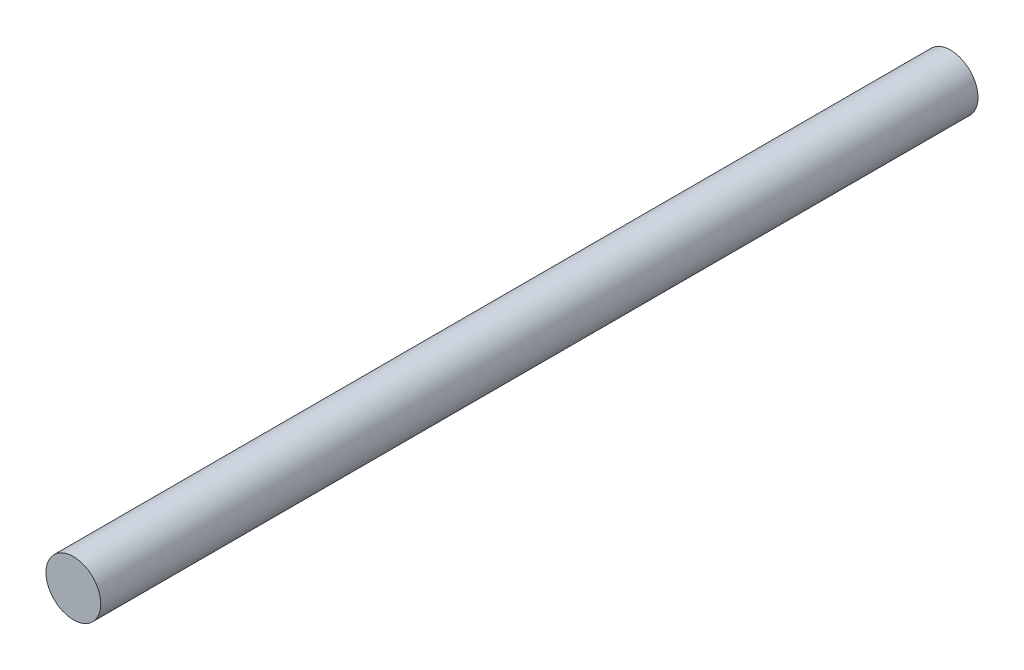
ISO-10303-21;
HEADER;
FILE_DESCRIPTION(('STEP AP214'),'2;1');
FILE_NAME('part.step','',(''),(''),'','','');
FILE_SCHEMA(('AUTOMOTIVE_DESIGN { 1 0 10303 214 1 1 1 1 }'));
ENDSEC;
DATA;
#1=APPLICATION_CONTEXT('core data for automotive mechanical design processes');
#2=APPLICATION_PROTOCOL_DEFINITION('international standard','automotive_design',2000,#1);
#3=PRODUCT_CONTEXT('',#1,'mechanical');
#4=PRODUCT('Part','Part','',(#3));
#5=PRODUCT_RELATED_PRODUCT_CATEGORY('part','',(#4));
#6=PRODUCT_DEFINITION_FORMATION('','',#4);
#7=PRODUCT_DEFINITION_CONTEXT('part definition',#1,'design');
#8=PRODUCT_DEFINITION('design','',#6,#7);
#9=PRODUCT_DEFINITION_SHAPE('','',#8);
#10=(LENGTH_UNIT() NAMED_UNIT(*) SI_UNIT(.MILLI.,.METRE.));
#11=(NAMED_UNIT(*) PLANE_ANGLE_UNIT() SI_UNIT($,.RADIAN.));
#12=(NAMED_UNIT(*) SI_UNIT($,.STERADIAN.) SOLID_ANGLE_UNIT());
#13=UNCERTAINTY_MEASURE_WITH_UNIT(LENGTH_MEASURE(1.E-05),#10,'distance_accuracy_value','');
#14=(GEOMETRIC_REPRESENTATION_CONTEXT(3) GLOBAL_UNCERTAINTY_ASSIGNED_CONTEXT((#13)) GLOBAL_UNIT_ASSIGNED_CONTEXT((#10,
#11,#12)) REPRESENTATION_CONTEXT('',''));
#15=CARTESIAN_POINT('',(0.,0.,0.));
#16=DIRECTION('',(0.,0.,1.));
#17=DIRECTION('',(1.,0.,0.));
#18=AXIS2_PLACEMENT_3D('',#15,#16,#17);
#19=CARTESIAN_POINT('',(0.,0.,-160.));
#20=DIRECTION('',(0.,0.,1.));
#21=DIRECTION('',(1.,0.,0.));
#22=AXIS2_PLACEMENT_3D('',#19,#20,#21);
#23=CYLINDRICAL_SURFACE('',#22,5.);
#24=CARTESIAN_POINT('',(0.,0.,-160.));
#25=DIRECTION('',(0.,0.,1.));
#26=DIRECTION('',(1.,0.,0.));
#27=AXIS2_PLACEMENT_3D('',#24,#25,#26);
#28=CIRCLE('',#27,5.);
#29=CARTESIAN_POINT('',(5.,0.,-160.));
#30=VERTEX_POINT('',#29);
#31=EDGE_CURVE('E10',#30,#30,#28,.T.);
#32=ORIENTED_EDGE('',*,*,#31,.T.);
#33=EDGE_LOOP('',(#32));
#34=FACE_BOUND('',#33,.T.);
#35=CARTESIAN_POINT('',(0.,0.,0.));
#36=DIRECTION('',(0.,0.,1.));
#37=DIRECTION('',(1.,0.,0.));
#38=AXIS2_PLACEMENT_3D('',#35,#36,#37);
#39=CIRCLE('',#38,5.);
#40=CARTESIAN_POINT('',(5.,0.,0.));
#41=VERTEX_POINT('',#40);
#42=EDGE_CURVE('E40',#41,#41,#39,.T.);
#43=ORIENTED_EDGE('',*,*,#42,.F.);
#44=EDGE_LOOP('',(#43));
#45=FACE_BOUND('',#44,.T.);
#46=ADVANCED_FACE('F37',(#34,#45),#23,.T.);
#47=CARTESIAN_POINT('',(0.,0.,-160.));
#48=DIRECTION('',(0.,0.,1.));
#49=DIRECTION('',(1.,0.,0.));
#50=AXIS2_PLACEMENT_3D('',#47,#48,#49);
#51=PLANE('',#50);
#52=ORIENTED_EDGE('',*,*,#31,.F.);
#53=EDGE_LOOP('',(#52));
#54=FACE_BOUND('',#53,.T.);
#55=ADVANCED_FACE('F52',(#54),#51,.F.);
#56=CARTESIAN_POINT('',(0.,0.,0.));
#57=DIRECTION('',(0.,0.,1.));
#58=DIRECTION('',(1.,0.,0.));
#59=AXIS2_PLACEMENT_3D('',#56,#57,#58);
#60=PLANE('',#59);
#61=ORIENTED_EDGE('',*,*,#42,.T.);
#62=EDGE_LOOP('',(#61));
#63=FACE_BOUND('',#62,.T.);
#64=ADVANCED_FACE('F49',(#63),#60,.T.);
#65=CLOSED_SHELL('',(#46,#55,#64));
#66=MANIFOLD_SOLID_BREP('B2',#65);
#67=ADVANCED_BREP_SHAPE_REPRESENTATION('',(#18,#66),#14);
#68=SHAPE_DEFINITION_REPRESENTATION(#9,#67);
ENDSEC;
END-ISO-10303-21;
